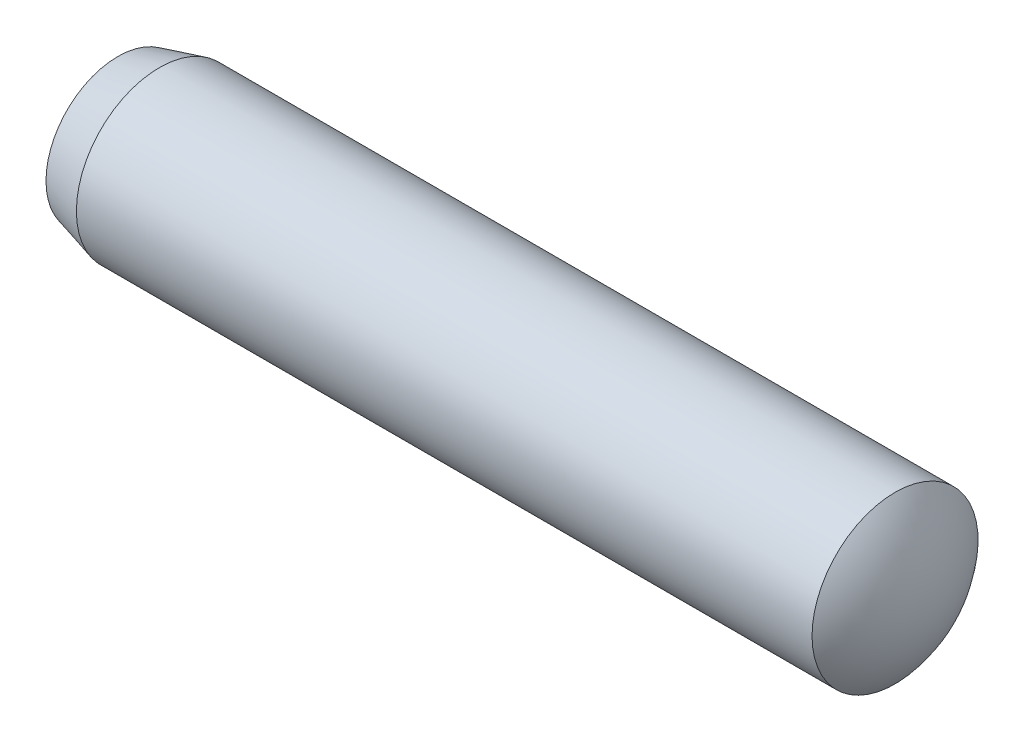
ISO-10303-21;
HEADER;
FILE_DESCRIPTION(('STEP AP214'),'2;1');
FILE_NAME('part.step','',(''),(''),'','','');
FILE_SCHEMA(('AUTOMOTIVE_DESIGN { 1 0 10303 214 1 1 1 1 }'));
ENDSEC;
DATA;
#1=APPLICATION_CONTEXT('core data for automotive mechanical design processes');
#2=APPLICATION_PROTOCOL_DEFINITION('international standard','automotive_design',2000,#1);
#3=PRODUCT_CONTEXT('',#1,'mechanical');
#4=PRODUCT('Part','Part','',(#3));
#5=PRODUCT_RELATED_PRODUCT_CATEGORY('part','',(#4));
#6=PRODUCT_DEFINITION_FORMATION('','',#4);
#7=PRODUCT_DEFINITION_CONTEXT('part definition',#1,'design');
#8=PRODUCT_DEFINITION('design','',#6,#7);
#9=PRODUCT_DEFINITION_SHAPE('','',#8);
#10=(LENGTH_UNIT() NAMED_UNIT(*) SI_UNIT(.MILLI.,.METRE.));
#11=(NAMED_UNIT(*) PLANE_ANGLE_UNIT() SI_UNIT($,.RADIAN.));
#12=(NAMED_UNIT(*) SI_UNIT($,.STERADIAN.) SOLID_ANGLE_UNIT());
#13=UNCERTAINTY_MEASURE_WITH_UNIT(LENGTH_MEASURE(1.E-05),#10,'distance_accuracy_value','');
#14=(GEOMETRIC_REPRESENTATION_CONTEXT(3) GLOBAL_UNCERTAINTY_ASSIGNED_CONTEXT((#13)) GLOBAL_UNIT_ASSIGNED_CONTEXT((#10,
#11,#12)) REPRESENTATION_CONTEXT('',''));
#15=CARTESIAN_POINT('',(0.,0.,0.));
#16=DIRECTION('',(0.,0.,1.));
#17=DIRECTION('',(1.,0.,0.));
#18=AXIS2_PLACEMENT_3D('',#15,#16,#17);
#19=CARTESIAN_POINT('',(8.46481624151203,0.,0.));
#20=DIRECTION('',(-1.,0.,0.));
#21=DIRECTION('',(0.,1.,0.));
#22=AXIS2_PLACEMENT_3D('',#19,#20,#21);
#23=SPHERICAL_SURFACE('',#22,1.53518375848797);
#24=CARTESIAN_POINT('',(9.62962917598917,0.,0.));
#25=DIRECTION('',(-1.,0.,0.));
#26=DIRECTION('',(0.,0.,1.));
#27=AXIS2_PLACEMENT_3D('',#24,#25,#26);
#28=CIRCLE('',#27,1.);
#29=CARTESIAN_POINT('',(9.62962917598917,0.,1.));
#30=VERTEX_POINT('',#29);
#31=EDGE_CURVE('E10',#30,#30,#28,.T.);
#32=ORIENTED_EDGE('',*,*,#31,.F.);
#33=EDGE_LOOP('',(#32));
#34=FACE_BOUND('',#33,.T.);
#35=ADVANCED_FACE('F33',(#34),#23,.T.);
#36=CARTESIAN_POINT('',(1.53518375848797,0.,0.));
#37=DIRECTION('',(-1.,0.,0.));
#38=DIRECTION('',(0.,0.,1.));
#39=AXIS2_PLACEMENT_3D('',#36,#37,#38);
#40=CYLINDRICAL_SURFACE('',#39,1.);
#41=CARTESIAN_POINT('',(0.767591879243987,0.,0.));
#42=DIRECTION('',(-1.,0.,0.));
#43=DIRECTION('',(0.,0.,1.));
#44=AXIS2_PLACEMENT_3D('',#41,#42,#43);
#45=CIRCLE('',#44,1.);
#46=CARTESIAN_POINT('',(0.767591879243987,0.,1.));
#47=VERTEX_POINT('',#46);
#48=EDGE_CURVE('E39',#47,#47,#45,.T.);
#49=ORIENTED_EDGE('',*,*,#48,.F.);
#50=EDGE_LOOP('',(#49));
#51=FACE_BOUND('',#50,.T.);
#52=ORIENTED_EDGE('',*,*,#31,.T.);
#53=EDGE_LOOP('',(#52));
#54=FACE_BOUND('',#53,.T.);
#55=ADVANCED_FACE('F54',(#51,#54),#40,.T.);
#56=CARTESIAN_POINT('',(0.767591879243987,0.,0.));
#57=DIRECTION('',(1.,0.,0.));
#58=DIRECTION('',(0.,0.,-1.));
#59=AXIS2_PLACEMENT_3D('',#56,#57,#58);
#60=CONICAL_SURFACE('',#59,1.,0.261799387799152);
#61=CARTESIAN_POINT('',(0.267591879244005,0.,0.));
#62=DIRECTION('',(-1.,0.,0.));
#63=DIRECTION('',(0.,0.,1.));
#64=AXIS2_PLACEMENT_3D('',#61,#62,#63);
#65=CIRCLE('',#64,0.866025403784442);
#66=CARTESIAN_POINT('',(0.267591879244005,0.,0.866025403784442));
#67=VERTEX_POINT('',#66);
#68=EDGE_CURVE('E43',#67,#67,#65,.T.);
#69=ORIENTED_EDGE('',*,*,#68,.F.);
#70=EDGE_LOOP('',(#69));
#71=FACE_BOUND('',#70,.T.);
#72=ORIENTED_EDGE('',*,*,#48,.T.);
#73=EDGE_LOOP('',(#72));
#74=FACE_BOUND('',#73,.T.);
#75=ADVANCED_FACE('F52',(#71,#74),#60,.T.);
#76=CARTESIAN_POINT('',(1.53518375848797,0.,0.));
#77=DIRECTION('',(-1.,0.,0.));
#78=DIRECTION('',(0.,1.,0.));
#79=AXIS2_PLACEMENT_3D('',#76,#77,#78);
#80=SPHERICAL_SURFACE('',#79,1.53518375848797);
#81=ORIENTED_EDGE('',*,*,#68,.T.);
#82=EDGE_LOOP('',(#81));
#83=FACE_BOUND('',#82,.T.);
#84=ADVANCED_FACE('F50',(#83),#80,.T.);
#85=CLOSED_SHELL('',(#35,#55,#75,#84));
#86=MANIFOLD_SOLID_BREP('B2',#85);
#87=ADVANCED_BREP_SHAPE_REPRESENTATION('',(#18,#86),#14);
#88=SHAPE_DEFINITION_REPRESENTATION(#9,#87);
ENDSEC;
END-ISO-10303-21;
